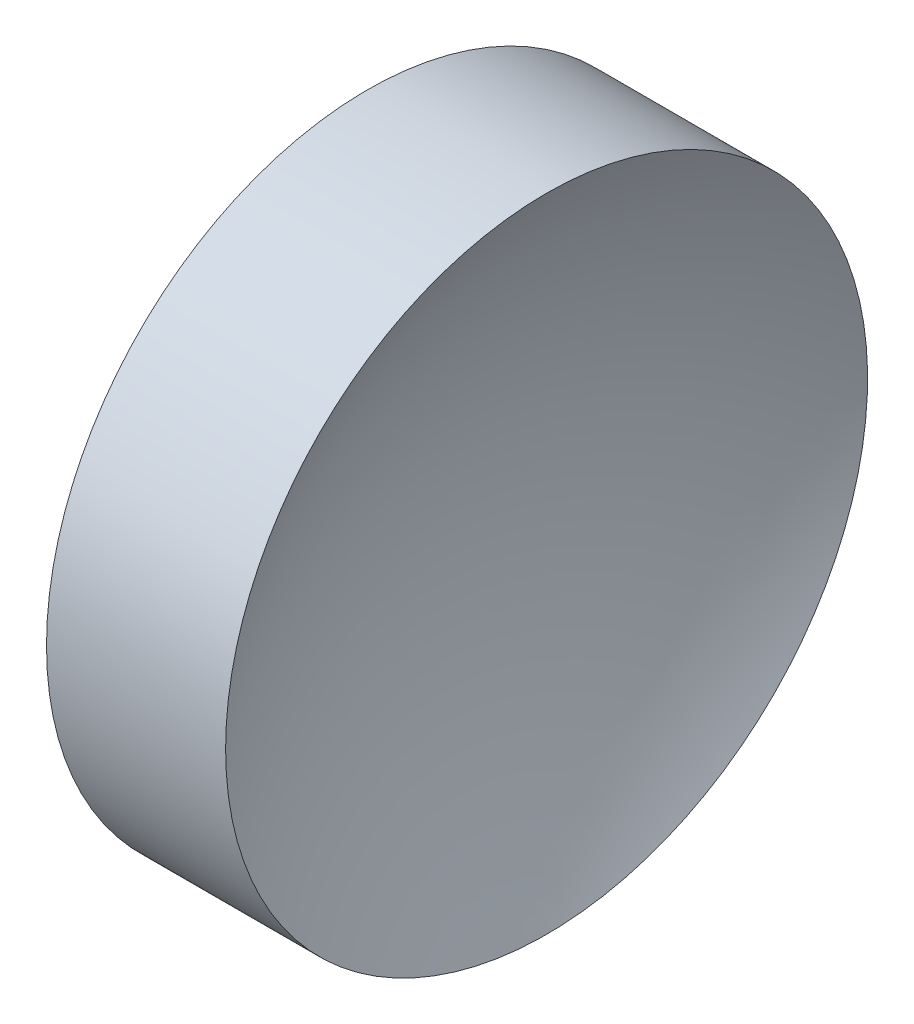
ISO-10303-21;
HEADER;
FILE_DESCRIPTION(('STEP AP214'),'2;1');
FILE_NAME('part.step','',(''),(''),'','','');
FILE_SCHEMA(('AUTOMOTIVE_DESIGN { 1 0 10303 214 1 1 1 1 }'));
ENDSEC;
DATA;
#1=APPLICATION_CONTEXT('core data for automotive mechanical design processes');
#2=APPLICATION_PROTOCOL_DEFINITION('international standard','automotive_design',2000,#1);
#3=PRODUCT_CONTEXT('',#1,'mechanical');
#4=PRODUCT('Part','Part','',(#3));
#5=PRODUCT_RELATED_PRODUCT_CATEGORY('part','',(#4));
#6=PRODUCT_DEFINITION_FORMATION('','',#4);
#7=PRODUCT_DEFINITION_CONTEXT('part definition',#1,'design');
#8=PRODUCT_DEFINITION('design','',#6,#7);
#9=PRODUCT_DEFINITION_SHAPE('','',#8);
#10=(LENGTH_UNIT() NAMED_UNIT(*) SI_UNIT(.MILLI.,.METRE.));
#11=(NAMED_UNIT(*) PLANE_ANGLE_UNIT() SI_UNIT($,.RADIAN.));
#12=(NAMED_UNIT(*) SI_UNIT($,.STERADIAN.) SOLID_ANGLE_UNIT());
#13=UNCERTAINTY_MEASURE_WITH_UNIT(LENGTH_MEASURE(1.E-05),#10,'distance_accuracy_value','');
#14=(GEOMETRIC_REPRESENTATION_CONTEXT(3) GLOBAL_UNCERTAINTY_ASSIGNED_CONTEXT((#13)) GLOBAL_UNIT_ASSIGNED_CONTEXT((#10,
#11,#12)) REPRESENTATION_CONTEXT('',''));
#15=CARTESIAN_POINT('',(0.,0.,0.));
#16=DIRECTION('',(0.,0.,1.));
#17=DIRECTION('',(1.,0.,0.));
#18=AXIS2_PLACEMENT_3D('',#15,#16,#17);
#19=CARTESIAN_POINT('',(56.1545191041816,26.089041149195,0.));
#20=DIRECTION('',(-1.,0.,0.));
#21=DIRECTION('',(0.,1.,0.));
#22=AXIS2_PLACEMENT_3D('',#19,#20,#21);
#23=SPHERICAL_SURFACE('',#22,10.3349322175744);
#24=CARTESIAN_POINT('',(47.1095854979103,26.089041149195,0.));
#25=DIRECTION('',(-1.,0.,0.));
#26=DIRECTION('',(0.,0.,1.));
#27=AXIS2_PLACEMENT_3D('',#24,#25,#26);
#28=CIRCLE('',#27,5.);
#29=CARTESIAN_POINT('',(47.1095854979103,26.089041149195,5.));
#30=VERTEX_POINT('',#29);
#31=EDGE_CURVE('E10',#30,#30,#28,.T.);
#32=ORIENTED_EDGE('',*,*,#31,.F.);
#33=EDGE_LOOP('',(#32));
#34=FACE_BOUND('',#33,.T.);
#35=ADVANCED_FACE('F35',(#34),#23,.F.);
#36=CARTESIAN_POINT('',(42.4498611141368,26.089041149195,0.));
#37=DIRECTION('',(-1.,0.,0.));
#38=DIRECTION('',(0.,0.,1.));
#39=AXIS2_PLACEMENT_3D('',#36,#37,#38);
#40=CYLINDRICAL_SURFACE('',#39,5.);
#41=CARTESIAN_POINT('',(44.3195854979103,26.089041149195,0.));
#42=DIRECTION('',(-1.,0.,0.));
#43=DIRECTION('',(0.,0.,1.));
#44=AXIS2_PLACEMENT_3D('',#41,#42,#43);
#45=CIRCLE('',#44,5.);
#46=CARTESIAN_POINT('',(44.3195854979103,26.089041149195,5.));
#47=VERTEX_POINT('',#46);
#48=EDGE_CURVE('E41',#47,#47,#45,.T.);
#49=ORIENTED_EDGE('',*,*,#48,.F.);
#50=EDGE_LOOP('',(#49));
#51=FACE_BOUND('',#50,.T.);
#52=ORIENTED_EDGE('',*,*,#31,.T.);
#53=EDGE_LOOP('',(#52));
#54=FACE_BOUND('',#53,.T.);
#55=ADVANCED_FACE('F49',(#51,#54),#40,.T.);
#56=CARTESIAN_POINT('',(44.3195854979103,26.089041149195,0.));
#57=DIRECTION('',(1.,0.,0.));
#58=DIRECTION('',(0.,0.,-1.));
#59=AXIS2_PLACEMENT_3D('',#56,#57,#58);
#60=PLANE('',#59);
#61=ORIENTED_EDGE('',*,*,#48,.T.);
#62=EDGE_LOOP('',(#61));
#63=FACE_BOUND('',#62,.T.);
#64=ADVANCED_FACE('F47',(#63),#60,.F.);
#65=CLOSED_SHELL('',(#35,#55,#64));
#66=MANIFOLD_SOLID_BREP('B2',#65);
#67=ADVANCED_BREP_SHAPE_REPRESENTATION('',(#18,#66),#14);
#68=SHAPE_DEFINITION_REPRESENTATION(#9,#67);
ENDSEC;
END-ISO-10303-21;
